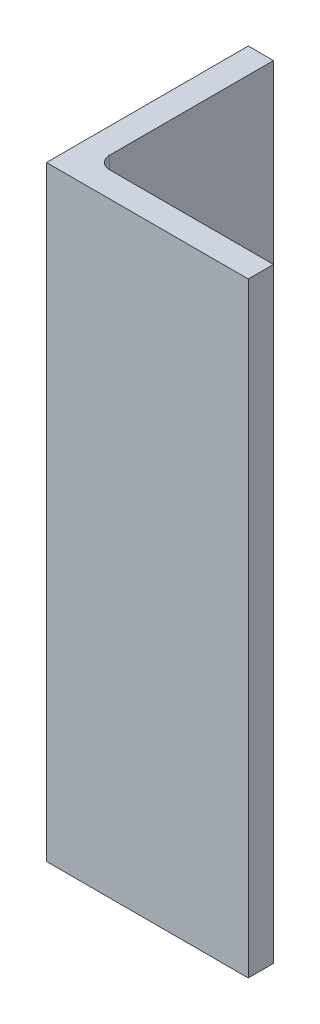
ISO-10303-21;
HEADER;
FILE_DESCRIPTION(('STEP AP214'),'2;1');
FILE_NAME('part.step','',(''),(''),'','','');
FILE_SCHEMA(('AUTOMOTIVE_DESIGN { 1 0 10303 214 1 1 1 1 }'));
ENDSEC;
DATA;
#1=APPLICATION_CONTEXT('core data for automotive mechanical design processes');
#2=APPLICATION_PROTOCOL_DEFINITION('international standard','automotive_design',2000,#1);
#3=PRODUCT_CONTEXT('',#1,'mechanical');
#4=PRODUCT('Part','Part','',(#3));
#5=PRODUCT_RELATED_PRODUCT_CATEGORY('part','',(#4));
#6=PRODUCT_DEFINITION_FORMATION('','',#4);
#7=PRODUCT_DEFINITION_CONTEXT('part definition',#1,'design');
#8=PRODUCT_DEFINITION('design','',#6,#7);
#9=PRODUCT_DEFINITION_SHAPE('','',#8);
#10=(LENGTH_UNIT() NAMED_UNIT(*) SI_UNIT(.MILLI.,.METRE.));
#11=(NAMED_UNIT(*) PLANE_ANGLE_UNIT() SI_UNIT($,.RADIAN.));
#12=(NAMED_UNIT(*) SI_UNIT($,.STERADIAN.) SOLID_ANGLE_UNIT());
#13=UNCERTAINTY_MEASURE_WITH_UNIT(LENGTH_MEASURE(1.E-05),#10,'distance_accuracy_value','');
#14=(GEOMETRIC_REPRESENTATION_CONTEXT(3) GLOBAL_UNCERTAINTY_ASSIGNED_CONTEXT((#13)) GLOBAL_UNIT_ASSIGNED_CONTEXT((#10,
#11,#12)) REPRESENTATION_CONTEXT('',''));
#15=CARTESIAN_POINT('',(0.,0.,0.));
#16=DIRECTION('',(0.,0.,1.));
#17=DIRECTION('',(1.,0.,0.));
#18=AXIS2_PLACEMENT_3D('',#15,#16,#17);
#19=CARTESIAN_POINT('',(50.8,152.4,0.));
#20=DIRECTION('',(0.,0.,-1.));
#21=DIRECTION('',(-1.,0.,0.));
#22=AXIS2_PLACEMENT_3D('',#19,#20,#21);
#23=PLANE('',#22);
#24=DIRECTION('',(1.,0.,0.));
#25=VECTOR('',#24,1.);
#26=CARTESIAN_POINT('',(50.8,0.,0.));
#27=LINE('',#26,#25);
#28=CARTESIAN_POINT('',(0.,0.,0.));
#29=VERTEX_POINT('',#28);
#30=CARTESIAN_POINT('',(50.8,0.,0.));
#31=VERTEX_POINT('',#30);
#32=EDGE_CURVE('E117',#29,#31,#27,.T.);
#33=ORIENTED_EDGE('',*,*,#32,.T.);
#34=DIRECTION('',(0.,-1.,0.));
#35=VECTOR('',#34,1.);
#36=CARTESIAN_POINT('',(50.8,152.4,0.));
#37=LINE('',#36,#35);
#38=CARTESIAN_POINT('',(50.8,152.4,0.));
#39=VERTEX_POINT('',#38);
#40=EDGE_CURVE('E99',#39,#31,#37,.T.);
#41=ORIENTED_EDGE('',*,*,#40,.F.);
#42=DIRECTION('',(1.,0.,0.));
#43=VECTOR('',#42,1.);
#44=CARTESIAN_POINT('',(50.8,152.4,0.));
#45=LINE('',#44,#43);
#46=CARTESIAN_POINT('',(0.,152.4,0.));
#47=VERTEX_POINT('',#46);
#48=EDGE_CURVE('E105',#47,#39,#45,.T.);
#49=ORIENTED_EDGE('',*,*,#48,.F.);
#50=DIRECTION('',(0.,-1.,0.));
#51=VECTOR('',#50,1.);
#52=CARTESIAN_POINT('',(0.,152.4,0.));
#53=LINE('',#52,#51);
#54=EDGE_CURVE('E131',#47,#29,#53,.T.);
#55=ORIENTED_EDGE('',*,*,#54,.T.);
#56=EDGE_LOOP('',(#33,#41,#49,#55));
#57=FACE_BOUND('',#56,.T.);
#58=ADVANCED_FACE('F36',(#57),#23,.F.);
#59=CARTESIAN_POINT('',(50.8,152.4,-6.35));
#60=DIRECTION('',(-1.,0.,0.));
#61=DIRECTION('',(0.,0.,1.));
#62=AXIS2_PLACEMENT_3D('',#59,#60,#61);
#63=PLANE('',#62);
#64=DIRECTION('',(0.,0.,-1.));
#65=VECTOR('',#64,1.);
#66=CARTESIAN_POINT('',(50.8,0.,-6.35));
#67=LINE('',#66,#65);
#68=CARTESIAN_POINT('',(50.8,0.,-6.35));
#69=VERTEX_POINT('',#68);
#70=EDGE_CURVE('E140',#31,#69,#67,.T.);
#71=ORIENTED_EDGE('',*,*,#70,.T.);
#72=DIRECTION('',(0.,-1.,0.));
#73=VECTOR('',#72,1.);
#74=CARTESIAN_POINT('',(50.8,152.4,-6.35));
#75=LINE('',#74,#73);
#76=CARTESIAN_POINT('',(50.8,152.4,-6.35));
#77=VERTEX_POINT('',#76);
#78=EDGE_CURVE('E102',#77,#69,#75,.T.);
#79=ORIENTED_EDGE('',*,*,#78,.F.);
#80=DIRECTION('',(0.,0.,-1.));
#81=VECTOR('',#80,1.);
#82=CARTESIAN_POINT('',(50.8,152.4,-6.35));
#83=LINE('',#82,#81);
#84=EDGE_CURVE('E95',#39,#77,#83,.T.);
#85=ORIENTED_EDGE('',*,*,#84,.F.);
#86=ORIENTED_EDGE('',*,*,#40,.T.);
#87=EDGE_LOOP('',(#71,#79,#85,#86));
#88=FACE_BOUND('',#87,.T.);
#89=ADVANCED_FACE('F97',(#88),#63,.F.);
#90=CARTESIAN_POINT('',(6.35,152.4,-6.35));
#91=DIRECTION('',(0.,0.,1.));
#92=DIRECTION('',(1.,0.,0.));
#93=AXIS2_PLACEMENT_3D('',#90,#91,#92);
#94=PLANE('',#93);
#95=DIRECTION('',(-1.,0.,0.));
#96=VECTOR('',#95,1.);
#97=CARTESIAN_POINT('',(6.35,0.,-6.35));
#98=LINE('',#97,#96);
#99=CARTESIAN_POINT('',(9.525,0.,-6.35));
#100=VERTEX_POINT('',#99);
#101=EDGE_CURVE('E138',#69,#100,#98,.T.);
#102=ORIENTED_EDGE('',*,*,#101,.T.);
#103=DIRECTION('',(0.,-1.,0.));
#104=VECTOR('',#103,1.);
#105=CARTESIAN_POINT('',(9.525,152.4,-6.35));
#106=LINE('',#105,#104);
#107=CARTESIAN_POINT('',(9.525,152.4,-6.35));
#108=VERTEX_POINT('',#107);
#109=EDGE_CURVE('E51',#100,#108,#106,.F.);
#110=ORIENTED_EDGE('',*,*,#109,.T.);
#111=DIRECTION('',(-1.,0.,0.));
#112=VECTOR('',#111,1.);
#113=CARTESIAN_POINT('',(6.35,152.4,-6.35));
#114=LINE('',#113,#112);
#115=EDGE_CURVE('E104',#77,#108,#114,.T.);
#116=ORIENTED_EDGE('',*,*,#115,.F.);
#117=ORIENTED_EDGE('',*,*,#78,.T.);
#118=EDGE_LOOP('',(#102,#110,#116,#117));
#119=FACE_BOUND('',#118,.T.);
#120=ADVANCED_FACE('F167',(#119),#94,.F.);
#121=CARTESIAN_POINT('',(6.35,152.4,-50.8));
#122=DIRECTION('',(-1.,0.,0.));
#123=DIRECTION('',(0.,0.,1.));
#124=AXIS2_PLACEMENT_3D('',#121,#122,#123);
#125=PLANE('',#124);
#126=CARTESIAN_POINT('',(6.35,31.75,-25.4));
#127=DIRECTION('',(-1.,0.,0.));
#128=DIRECTION('',(0.,0.,1.));
#129=AXIS2_PLACEMENT_3D('',#126,#127,#128);
#130=CIRCLE('',#129,9.52499999999999);
#131=CARTESIAN_POINT('',(6.35,31.75,-15.875));
#132=VERTEX_POINT('',#131);
#133=EDGE_CURVE('E143',#132,#132,#130,.T.);
#134=ORIENTED_EDGE('',*,*,#133,.T.);
#135=EDGE_LOOP('',(#134));
#136=FACE_BOUND('',#135,.T.);
#137=DIRECTION('',(0.,0.,-1.));
#138=VECTOR('',#137,1.);
#139=CARTESIAN_POINT('',(6.35,152.4,-50.8));
#140=LINE('',#139,#138);
#141=CARTESIAN_POINT('',(6.35,152.4,-9.52500000000001));
#142=VERTEX_POINT('',#141);
#143=CARTESIAN_POINT('',(6.35,152.4,-50.8));
#144=VERTEX_POINT('',#143);
#145=EDGE_CURVE('E147',#142,#144,#140,.T.);
#146=ORIENTED_EDGE('',*,*,#145,.F.);
#147=DIRECTION('',(0.,-1.,0.));
#148=VECTOR('',#147,1.);
#149=CARTESIAN_POINT('',(6.35,0.,-9.52500000000001));
#150=LINE('',#149,#148);
#151=CARTESIAN_POINT('',(6.35,0.,-9.52500000000001));
#152=VERTEX_POINT('',#151);
#153=EDGE_CURVE('E118',#142,#152,#150,.T.);
#154=ORIENTED_EDGE('',*,*,#153,.T.);
#155=DIRECTION('',(0.,0.,-1.));
#156=VECTOR('',#155,1.);
#157=CARTESIAN_POINT('',(6.35,0.,-50.8));
#158=LINE('',#157,#156);
#159=CARTESIAN_POINT('',(6.35,0.,-50.8));
#160=VERTEX_POINT('',#159);
#161=EDGE_CURVE('E136',#152,#160,#158,.T.);
#162=ORIENTED_EDGE('',*,*,#161,.T.);
#163=DIRECTION('',(0.,-1.,0.));
#164=VECTOR('',#163,1.);
#165=CARTESIAN_POINT('',(6.35,152.4,-50.8));
#166=LINE('',#165,#164);
#167=EDGE_CURVE('E122',#144,#160,#166,.T.);
#168=ORIENTED_EDGE('',*,*,#167,.F.);
#169=EDGE_LOOP('',(#146,#154,#162,#168));
#170=FACE_BOUND('',#169,.T.);
#171=ADVANCED_FACE('F173',(#136,#170),#125,.F.);
#172=CARTESIAN_POINT('',(0.,152.4,-50.8));
#173=DIRECTION('',(0.,0.,1.));
#174=DIRECTION('',(1.,0.,0.));
#175=AXIS2_PLACEMENT_3D('',#172,#173,#174);
#176=PLANE('',#175);
#177=DIRECTION('',(-1.,0.,0.));
#178=VECTOR('',#177,1.);
#179=CARTESIAN_POINT('',(0.,0.,-50.8));
#180=LINE('',#179,#178);
#181=CARTESIAN_POINT('',(0.,0.,-50.8));
#182=VERTEX_POINT('',#181);
#183=EDGE_CURVE('E134',#160,#182,#180,.T.);
#184=ORIENTED_EDGE('',*,*,#183,.T.);
#185=DIRECTION('',(0.,-1.,0.));
#186=VECTOR('',#185,1.);
#187=CARTESIAN_POINT('',(0.,152.4,-50.8));
#188=LINE('',#187,#186);
#189=CARTESIAN_POINT('',(0.,152.4,-50.8));
#190=VERTEX_POINT('',#189);
#191=EDGE_CURVE('E128',#190,#182,#188,.T.);
#192=ORIENTED_EDGE('',*,*,#191,.F.);
#193=DIRECTION('',(-1.,0.,0.));
#194=VECTOR('',#193,1.);
#195=CARTESIAN_POINT('',(0.,152.4,-50.8));
#196=LINE('',#195,#194);
#197=EDGE_CURVE('E145',#144,#190,#196,.T.);
#198=ORIENTED_EDGE('',*,*,#197,.F.);
#199=ORIENTED_EDGE('',*,*,#167,.T.);
#200=EDGE_LOOP('',(#184,#192,#198,#199));
#201=FACE_BOUND('',#200,.T.);
#202=ADVANCED_FACE('F161',(#201),#176,.F.);
#203=CARTESIAN_POINT('',(0.,152.4,0.));
#204=DIRECTION('',(1.,0.,0.));
#205=DIRECTION('',(0.,0.,-1.));
#206=AXIS2_PLACEMENT_3D('',#203,#204,#205);
#207=PLANE('',#206);
#208=CARTESIAN_POINT('',(0.,31.75,-25.4));
#209=DIRECTION('',(-1.,0.,0.));
#210=DIRECTION('',(0.,0.,1.));
#211=AXIS2_PLACEMENT_3D('',#208,#209,#210);
#212=CIRCLE('',#211,9.52499999999998);
#213=CARTESIAN_POINT('',(0.,31.75,-15.875));
#214=VERTEX_POINT('',#213);
#215=EDGE_CURVE('E152',#214,#214,#212,.T.);
#216=ORIENTED_EDGE('',*,*,#215,.F.);
#217=EDGE_LOOP('',(#216));
#218=FACE_BOUND('',#217,.T.);
#219=DIRECTION('',(0.,0.,1.));
#220=VECTOR('',#219,1.);
#221=CARTESIAN_POINT('',(0.,0.,0.));
#222=LINE('',#221,#220);
#223=EDGE_CURVE('E114',#182,#29,#222,.T.);
#224=ORIENTED_EDGE('',*,*,#223,.T.);
#225=ORIENTED_EDGE('',*,*,#54,.F.);
#226=DIRECTION('',(0.,0.,1.));
#227=VECTOR('',#226,1.);
#228=CARTESIAN_POINT('',(0.,152.4,0.));
#229=LINE('',#228,#227);
#230=EDGE_CURVE('E110',#190,#47,#229,.T.);
#231=ORIENTED_EDGE('',*,*,#230,.F.);
#232=ORIENTED_EDGE('',*,*,#191,.T.);
#233=EDGE_LOOP('',(#224,#225,#231,#232));
#234=FACE_BOUND('',#233,.T.);
#235=ADVANCED_FACE('F158',(#218,#234),#207,.F.);
#236=CARTESIAN_POINT('',(0.,152.4,0.));
#237=DIRECTION('',(0.,-1.,0.));
#238=DIRECTION('',(0.,0.,-1.));
#239=AXIS2_PLACEMENT_3D('',#236,#237,#238);
#240=PLANE('',#239);
#241=ORIENTED_EDGE('',*,*,#48,.T.);
#242=ORIENTED_EDGE('',*,*,#84,.T.);
#243=ORIENTED_EDGE('',*,*,#115,.T.);
#244=CARTESIAN_POINT('',(9.525,152.4,-9.52500000000001));
#245=DIRECTION('',(0.,-1.,0.));
#246=DIRECTION('',(0.,0.,-1.));
#247=AXIS2_PLACEMENT_3D('',#244,#245,#246);
#248=CIRCLE('',#247,3.175);
#249=EDGE_CURVE('E11',#108,#142,#248,.T.);
#250=ORIENTED_EDGE('',*,*,#249,.T.);
#251=ORIENTED_EDGE('',*,*,#145,.T.);
#252=ORIENTED_EDGE('',*,*,#197,.T.);
#253=ORIENTED_EDGE('',*,*,#230,.T.);
#254=EDGE_LOOP('',(#241,#242,#243,#250,#251,#252,#253));
#255=FACE_BOUND('',#254,.T.);
#256=ADVANCED_FACE('F108',(#255),#240,.F.);
#257=CARTESIAN_POINT('',(0.,0.,0.));
#258=DIRECTION('',(0.,-1.,0.));
#259=DIRECTION('',(0.,0.,-1.));
#260=AXIS2_PLACEMENT_3D('',#257,#258,#259);
#261=PLANE('',#260);
#262=ORIENTED_EDGE('',*,*,#32,.F.);
#263=ORIENTED_EDGE('',*,*,#223,.F.);
#264=ORIENTED_EDGE('',*,*,#183,.F.);
#265=ORIENTED_EDGE('',*,*,#161,.F.);
#266=CARTESIAN_POINT('',(9.525,0.,-9.52500000000001));
#267=DIRECTION('',(0.,-1.,0.));
#268=DIRECTION('',(0.,0.,-1.));
#269=AXIS2_PLACEMENT_3D('',#266,#267,#268);
#270=CIRCLE('',#269,3.175);
#271=EDGE_CURVE('E44',#152,#100,#270,.F.);
#272=ORIENTED_EDGE('',*,*,#271,.T.);
#273=ORIENTED_EDGE('',*,*,#101,.F.);
#274=ORIENTED_EDGE('',*,*,#70,.F.);
#275=EDGE_LOOP('',(#262,#263,#264,#265,#272,#273,#274));
#276=FACE_BOUND('',#275,.T.);
#277=ADVANCED_FACE('F166',(#276),#261,.T.);
#278=CARTESIAN_POINT('',(9.525,152.4,-9.52500000000001));
#279=DIRECTION('',(0.,1.,0.));
#280=DIRECTION('',(0.,0.,1.));
#281=AXIS2_PLACEMENT_3D('',#278,#279,#280);
#282=CYLINDRICAL_SURFACE('',#281,3.175);
#283=ORIENTED_EDGE('',*,*,#249,.F.);
#284=ORIENTED_EDGE('',*,*,#109,.F.);
#285=ORIENTED_EDGE('',*,*,#271,.F.);
#286=ORIENTED_EDGE('',*,*,#153,.F.);
#287=EDGE_LOOP('',(#283,#284,#285,#286));
#288=FACE_BOUND('',#287,.T.);
#289=ADVANCED_FACE('F38',(#288),#282,.F.);
#290=CARTESIAN_POINT('',(0.,31.75,-25.4));
#291=DIRECTION('',(-1.,0.,0.));
#292=DIRECTION('',(0.,0.,1.));
#293=AXIS2_PLACEMENT_3D('',#290,#291,#292);
#294=CYLINDRICAL_SURFACE('',#293,9.52499999999999);
#295=ORIENTED_EDGE('',*,*,#133,.F.);
#296=EDGE_LOOP('',(#295));
#297=FACE_BOUND('',#296,.T.);
#298=ORIENTED_EDGE('',*,*,#215,.T.);
#299=EDGE_LOOP('',(#298));
#300=FACE_BOUND('',#299,.T.);
#301=ADVANCED_FACE('F156',(#297,#300),#294,.F.);
#302=CLOSED_SHELL('',(#58,#89,#120,#171,#202,#235,#256,#277,#289,#301));
#303=MANIFOLD_SOLID_BREP('B2',#302);
#304=ADVANCED_BREP_SHAPE_REPRESENTATION('',(#18,#303),#14);
#305=SHAPE_DEFINITION_REPRESENTATION(#9,#304);
ENDSEC;
END-ISO-10303-21;
